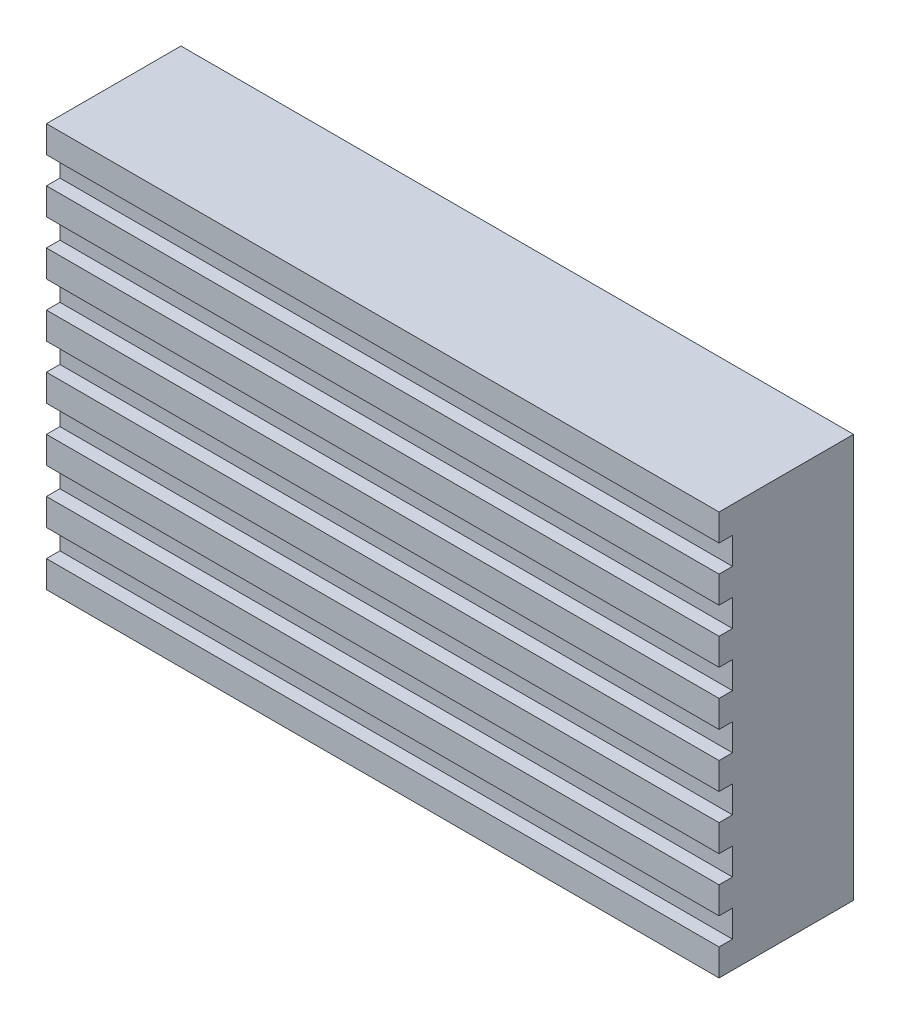
ISO-10303-21;
HEADER;
FILE_DESCRIPTION(('STEP AP214'),'2;1');
FILE_NAME('part.step','',(''),(''),'','','');
FILE_SCHEMA(('AUTOMOTIVE_DESIGN { 1 0 10303 214 1 1 1 1 }'));
ENDSEC;
DATA;
#1=APPLICATION_CONTEXT('core data for automotive mechanical design processes');
#2=APPLICATION_PROTOCOL_DEFINITION('international standard','automotive_design',2000,#1);
#3=PRODUCT_CONTEXT('',#1,'mechanical');
#4=PRODUCT('Part','Part','',(#3));
#5=PRODUCT_RELATED_PRODUCT_CATEGORY('part','',(#4));
#6=PRODUCT_DEFINITION_FORMATION('','',#4);
#7=PRODUCT_DEFINITION_CONTEXT('part definition',#1,'design');
#8=PRODUCT_DEFINITION('design','',#6,#7);
#9=PRODUCT_DEFINITION_SHAPE('','',#8);
#10=(LENGTH_UNIT() NAMED_UNIT(*) SI_UNIT(.MILLI.,.METRE.));
#11=(NAMED_UNIT(*) PLANE_ANGLE_UNIT() SI_UNIT($,.RADIAN.));
#12=(NAMED_UNIT(*) SI_UNIT($,.STERADIAN.) SOLID_ANGLE_UNIT());
#13=UNCERTAINTY_MEASURE_WITH_UNIT(LENGTH_MEASURE(1.E-05),#10,'distance_accuracy_value','');
#14=(GEOMETRIC_REPRESENTATION_CONTEXT(3) GLOBAL_UNCERTAINTY_ASSIGNED_CONTEXT((#13)) GLOBAL_UNIT_ASSIGNED_CONTEXT((#10,
#11,#12)) REPRESENTATION_CONTEXT('',''));
#15=CARTESIAN_POINT('',(0.,0.,0.));
#16=DIRECTION('',(0.,0.,1.));
#17=DIRECTION('',(1.,0.,0.));
#18=AXIS2_PLACEMENT_3D('',#15,#16,#17);
#19=CARTESIAN_POINT('',(0.,0.,10.));
#20=DIRECTION('',(0.,0.,-1.));
#21=DIRECTION('',(-1.,0.,0.));
#22=AXIS2_PLACEMENT_3D('',#19,#20,#21);
#23=PLANE('',#22);
#24=DIRECTION('',(0.,-1.,0.));
#25=VECTOR('',#24,1.);
#26=CARTESIAN_POINT('',(-50.,0.,10.));
#27=LINE('',#26,#25);
#28=CARTESIAN_POINT('',(-50.,-24.,10.));
#29=VERTEX_POINT('',#28);
#30=CARTESIAN_POINT('',(-49.9999999999998,-26.,10.));
#31=VERTEX_POINT('',#30);
#32=EDGE_CURVE('E489',#29,#31,#27,.T.);
#33=ORIENTED_EDGE('',*,*,#32,.T.);
#34=DIRECTION('',(-1.,0.,0.));
#35=VECTOR('',#34,1.);
#36=CARTESIAN_POINT('',(-49.9999999999998,-26.,10.));
#37=LINE('',#36,#35);
#38=CARTESIAN_POINT('',(2.55060596794148E-13,-26.,10.));
#39=VERTEX_POINT('',#38);
#40=EDGE_CURVE('E250',#39,#31,#37,.T.);
#41=ORIENTED_EDGE('',*,*,#40,.F.);
#42=DIRECTION('',(0.,1.,0.));
#43=VECTOR('',#42,1.);
#44=CARTESIAN_POINT('',(0.,0.,10.));
#45=LINE('',#44,#43);
#46=CARTESIAN_POINT('',(2.34111708761089E-13,-24.,10.));
#47=VERTEX_POINT('',#46);
#48=EDGE_CURVE('E445',#39,#47,#45,.T.);
#49=ORIENTED_EDGE('',*,*,#48,.T.);
#50=DIRECTION('',(1.,0.,0.));
#51=VECTOR('',#50,1.);
#52=CARTESIAN_POINT('',(-49.9999999999998,-24.,10.));
#53=LINE('',#52,#51);
#54=EDGE_CURVE('E286',#29,#47,#53,.T.);
#55=ORIENTED_EDGE('',*,*,#54,.F.);
#56=EDGE_LOOP('',(#33,#41,#49,#55));
#57=FACE_BOUND('',#56,.T.);
#58=ADVANCED_FACE('F35',(#57),#23,.F.);
#59=CARTESIAN_POINT('',(-50.,-20.,10.));
#60=VERTEX_POINT('',#59);
#61=CARTESIAN_POINT('',(-49.9999999999998,-22.,10.));
#62=VERTEX_POINT('',#61);
#63=EDGE_CURVE('E490',#60,#62,#27,.T.);
#64=ORIENTED_EDGE('',*,*,#63,.T.);
#65=DIRECTION('',(-1.,0.,0.));
#66=VECTOR('',#65,1.);
#67=CARTESIAN_POINT('',(-49.9999999999998,-22.,10.));
#68=LINE('',#67,#66);
#69=CARTESIAN_POINT('',(2.1316282072803E-13,-22.,10.));
#70=VERTEX_POINT('',#69);
#71=EDGE_CURVE('E277',#70,#62,#68,.T.);
#72=ORIENTED_EDGE('',*,*,#71,.F.);
#73=CARTESIAN_POINT('',(1.92213932694971E-13,-20.,10.));
#74=VERTEX_POINT('',#73);
#75=EDGE_CURVE('E826',#70,#74,#45,.T.);
#76=ORIENTED_EDGE('',*,*,#75,.T.);
#77=DIRECTION('',(1.,0.,0.));
#78=VECTOR('',#77,1.);
#79=CARTESIAN_POINT('',(-49.9999999999998,-20.,10.));
#80=LINE('',#79,#78);
#81=EDGE_CURVE('E311',#60,#74,#80,.T.);
#82=ORIENTED_EDGE('',*,*,#81,.F.);
#83=EDGE_LOOP('',(#64,#72,#76,#82));
#84=FACE_BOUND('',#83,.T.);
#85=ADVANCED_FACE('F551',(#84),#23,.F.);
#86=CARTESIAN_POINT('',(-50.,-16.,10.));
#87=VERTEX_POINT('',#86);
#88=CARTESIAN_POINT('',(-49.9999999999998,-18.,10.));
#89=VERTEX_POINT('',#88);
#90=EDGE_CURVE('E493',#87,#89,#27,.T.);
#91=ORIENTED_EDGE('',*,*,#90,.T.);
#92=DIRECTION('',(-1.,0.,0.));
#93=VECTOR('',#92,1.);
#94=CARTESIAN_POINT('',(-49.9999999999998,-18.,10.));
#95=LINE('',#94,#93);
#96=CARTESIAN_POINT('',(1.71265044661912E-13,-18.,10.));
#97=VERTEX_POINT('',#96);
#98=EDGE_CURVE('E300',#97,#89,#95,.T.);
#99=ORIENTED_EDGE('',*,*,#98,.F.);
#100=CARTESIAN_POINT('',(1.50316156628854E-13,-16.,10.));
#101=VERTEX_POINT('',#100);
#102=EDGE_CURVE('E833',#97,#101,#45,.T.);
#103=ORIENTED_EDGE('',*,*,#102,.T.);
#104=DIRECTION('',(1.,0.,0.));
#105=VECTOR('',#104,1.);
#106=CARTESIAN_POINT('',(-49.9999999999999,-16.,10.));
#107=LINE('',#106,#105);
#108=EDGE_CURVE('E338',#87,#101,#107,.T.);
#109=ORIENTED_EDGE('',*,*,#108,.F.);
#110=EDGE_LOOP('',(#91,#99,#103,#109));
#111=FACE_BOUND('',#110,.T.);
#112=ADVANCED_FACE('F557',(#111),#23,.F.);
#113=CARTESIAN_POINT('',(-50.,-12.,10.));
#114=VERTEX_POINT('',#113);
#115=CARTESIAN_POINT('',(-49.9999999999999,-14.,10.));
#116=VERTEX_POINT('',#115);
#117=EDGE_CURVE('E499',#114,#116,#27,.T.);
#118=ORIENTED_EDGE('',*,*,#117,.T.);
#119=DIRECTION('',(-1.,0.,0.));
#120=VECTOR('',#119,1.);
#121=CARTESIAN_POINT('',(-49.9999999999999,-14.,10.));
#122=LINE('',#121,#120);
#123=CARTESIAN_POINT('',(1.29367268595795E-13,-14.,10.));
#124=VERTEX_POINT('',#123);
#125=EDGE_CURVE('E326',#124,#116,#122,.T.);
#126=ORIENTED_EDGE('',*,*,#125,.F.);
#127=CARTESIAN_POINT('',(1.08418380562736E-13,-12.,10.));
#128=VERTEX_POINT('',#127);
#129=EDGE_CURVE('E535',#124,#128,#45,.T.);
#130=ORIENTED_EDGE('',*,*,#129,.T.);
#131=DIRECTION('',(1.,0.,0.));
#132=VECTOR('',#131,1.);
#133=CARTESIAN_POINT('',(-49.9999999999999,-12.,10.));
#134=LINE('',#133,#132);
#135=EDGE_CURVE('E365',#114,#128,#134,.T.);
#136=ORIENTED_EDGE('',*,*,#135,.F.);
#137=EDGE_LOOP('',(#118,#126,#130,#136));
#138=FACE_BOUND('',#137,.T.);
#139=ADVANCED_FACE('F574',(#138),#23,.F.);
#140=CARTESIAN_POINT('',(-50.,-8.,10.));
#141=VERTEX_POINT('',#140);
#142=CARTESIAN_POINT('',(-49.9999999999999,-10.,10.));
#143=VERTEX_POINT('',#142);
#144=EDGE_CURVE('E505',#141,#143,#27,.T.);
#145=ORIENTED_EDGE('',*,*,#144,.T.);
#146=DIRECTION('',(-1.,0.,0.));
#147=VECTOR('',#146,1.);
#148=CARTESIAN_POINT('',(-49.9999999999999,-10.,10.));
#149=LINE('',#148,#147);
#150=CARTESIAN_POINT('',(0.,-10.,10.));
#151=VERTEX_POINT('',#150);
#152=EDGE_CURVE('E353',#151,#143,#149,.T.);
#153=ORIENTED_EDGE('',*,*,#152,.F.);
#154=CARTESIAN_POINT('',(0.,-8.,10.));
#155=VERTEX_POINT('',#154);
#156=EDGE_CURVE('E534',#151,#155,#45,.T.);
#157=ORIENTED_EDGE('',*,*,#156,.T.);
#158=DIRECTION('',(1.,0.,0.));
#159=VECTOR('',#158,1.);
#160=CARTESIAN_POINT('',(-49.9999999999999,-8.,10.));
#161=LINE('',#160,#159);
#162=EDGE_CURVE('E392',#141,#155,#161,.T.);
#163=ORIENTED_EDGE('',*,*,#162,.F.);
#164=EDGE_LOOP('',(#145,#153,#157,#163));
#165=FACE_BOUND('',#164,.T.);
#166=ADVANCED_FACE('F570',(#165),#23,.F.);
#167=CARTESIAN_POINT('',(-50.,-4.,10.));
#168=VERTEX_POINT('',#167);
#169=CARTESIAN_POINT('',(-50.,-6.,10.));
#170=VERTEX_POINT('',#169);
#171=EDGE_CURVE('E453',#168,#170,#27,.T.);
#172=ORIENTED_EDGE('',*,*,#171,.T.);
#173=DIRECTION('',(-1.,0.,0.));
#174=VECTOR('',#173,1.);
#175=CARTESIAN_POINT('',(-50.,-6.,10.));
#176=LINE('',#175,#174);
#177=CARTESIAN_POINT('',(0.,-6.,10.));
#178=VERTEX_POINT('',#177);
#179=EDGE_CURVE('E380',#178,#170,#176,.T.);
#180=ORIENTED_EDGE('',*,*,#179,.F.);
#181=CARTESIAN_POINT('',(0.,-4.,10.));
#182=VERTEX_POINT('',#181);
#183=EDGE_CURVE('E532',#178,#182,#45,.T.);
#184=ORIENTED_EDGE('',*,*,#183,.T.);
#185=DIRECTION('',(1.,0.,0.));
#186=VECTOR('',#185,1.);
#187=CARTESIAN_POINT('',(-50.,-4.,10.));
#188=LINE('',#187,#186);
#189=EDGE_CURVE('E407',#168,#182,#188,.T.);
#190=ORIENTED_EDGE('',*,*,#189,.F.);
#191=EDGE_LOOP('',(#172,#180,#184,#190));
#192=FACE_BOUND('',#191,.T.);
#193=ADVANCED_FACE('F520',(#192),#23,.F.);
#194=CARTESIAN_POINT('',(-50.,0.,10.));
#195=VERTEX_POINT('',#194);
#196=CARTESIAN_POINT('',(-50.,-2.,10.));
#197=VERTEX_POINT('',#196);
#198=EDGE_CURVE('E449',#195,#197,#27,.T.);
#199=ORIENTED_EDGE('',*,*,#198,.T.);
#200=DIRECTION('',(-1.,0.,0.));
#201=VECTOR('',#200,1.);
#202=CARTESIAN_POINT('',(-50.,-2.,10.));
#203=LINE('',#202,#201);
#204=CARTESIAN_POINT('',(0.,-2.,10.));
#205=VERTEX_POINT('',#204);
#206=EDGE_CURVE('E419',#205,#197,#203,.T.);
#207=ORIENTED_EDGE('',*,*,#206,.F.);
#208=CARTESIAN_POINT('',(0.,0.,10.));
#209=VERTEX_POINT('',#208);
#210=EDGE_CURVE('E446',#205,#209,#45,.T.);
#211=ORIENTED_EDGE('',*,*,#210,.T.);
#212=DIRECTION('',(-1.,0.,0.));
#213=VECTOR('',#212,1.);
#214=CARTESIAN_POINT('',(0.,0.,10.));
#215=LINE('',#214,#213);
#216=EDGE_CURVE('E444',#209,#195,#215,.T.);
#217=ORIENTED_EDGE('',*,*,#216,.T.);
#218=EDGE_LOOP('',(#199,#207,#211,#217));
#219=FACE_BOUND('',#218,.T.);
#220=ADVANCED_FACE('F539',(#219),#23,.F.);
#221=CARTESIAN_POINT('',(0.,0.,10.));
#222=DIRECTION('',(-1.,0.,0.));
#223=DIRECTION('',(0.,-1.,0.));
#224=AXIS2_PLACEMENT_3D('',#221,#222,#223);
#225=PLANE('',#224);
#226=ORIENTED_EDGE('',*,*,#48,.F.);
#227=DIRECTION('',(0.,0.,1.));
#228=VECTOR('',#227,1.);
#229=CARTESIAN_POINT('',(2.55060596794148E-13,-26.,9.));
#230=LINE('',#229,#228);
#231=CARTESIAN_POINT('',(2.55060596794148E-13,-26.,9.));
#232=VERTEX_POINT('',#231);
#233=EDGE_CURVE('E275',#232,#39,#230,.T.);
#234=ORIENTED_EDGE('',*,*,#233,.F.);
#235=DIRECTION('',(0.,1.,0.));
#236=VECTOR('',#235,1.);
#237=CARTESIAN_POINT('',(2.55060596794148E-13,-26.,9.));
#238=LINE('',#237,#236);
#239=CARTESIAN_POINT('',(2.76009484827206E-13,-28.,9.));
#240=VERTEX_POINT('',#239);
#241=EDGE_CURVE('E255',#240,#232,#238,.T.);
#242=ORIENTED_EDGE('',*,*,#241,.F.);
#243=DIRECTION('',(0.,0.,1.));
#244=VECTOR('',#243,1.);
#245=CARTESIAN_POINT('',(2.76009484827206E-13,-28.,9.));
#246=LINE('',#245,#244);
#247=CARTESIAN_POINT('',(2.76009484827206E-13,-28.,10.));
#248=VERTEX_POINT('',#247);
#249=EDGE_CURVE('E278',#240,#248,#246,.T.);
#250=ORIENTED_EDGE('',*,*,#249,.T.);
#251=CARTESIAN_POINT('',(0.,-30.,10.));
#252=VERTEX_POINT('',#251);
#253=EDGE_CURVE('E441',#252,#248,#45,.T.);
#254=ORIENTED_EDGE('',*,*,#253,.F.);
#255=DIRECTION('',(0.,0.,-1.));
#256=VECTOR('',#255,1.);
#257=CARTESIAN_POINT('',(0.,-30.,10.));
#258=LINE('',#257,#256);
#259=CARTESIAN_POINT('',(0.,-30.,0.));
#260=VERTEX_POINT('',#259);
#261=EDGE_CURVE('E455',#252,#260,#258,.T.);
#262=ORIENTED_EDGE('',*,*,#261,.T.);
#263=DIRECTION('',(0.,1.,0.));
#264=VECTOR('',#263,1.);
#265=CARTESIAN_POINT('',(0.,0.,0.));
#266=LINE('',#265,#264);
#267=CARTESIAN_POINT('',(0.,0.,0.));
#268=VERTEX_POINT('',#267);
#269=EDGE_CURVE('E434',#260,#268,#266,.T.);
#270=ORIENTED_EDGE('',*,*,#269,.T.);
#271=DIRECTION('',(0.,0.,-1.));
#272=VECTOR('',#271,1.);
#273=CARTESIAN_POINT('',(0.,0.,10.));
#274=LINE('',#273,#272);
#275=EDGE_CURVE('E11',#209,#268,#274,.T.);
#276=ORIENTED_EDGE('',*,*,#275,.F.);
#277=ORIENTED_EDGE('',*,*,#210,.F.);
#278=DIRECTION('',(0.,0.,1.));
#279=VECTOR('',#278,1.);
#280=CARTESIAN_POINT('',(0.,-2.,9.));
#281=LINE('',#280,#279);
#282=CARTESIAN_POINT('',(0.,-2.,9.));
#283=VERTEX_POINT('',#282);
#284=EDGE_CURVE('E435',#283,#205,#281,.T.);
#285=ORIENTED_EDGE('',*,*,#284,.F.);
#286=DIRECTION('',(0.,1.,0.));
#287=VECTOR('',#286,1.);
#288=CARTESIAN_POINT('',(0.,-2.,9.));
#289=LINE('',#288,#287);
#290=CARTESIAN_POINT('',(0.,-4.,9.));
#291=VERTEX_POINT('',#290);
#292=EDGE_CURVE('E422',#291,#283,#289,.T.);
#293=ORIENTED_EDGE('',*,*,#292,.F.);
#294=DIRECTION('',(0.,0.,1.));
#295=VECTOR('',#294,1.);
#296=CARTESIAN_POINT('',(0.,-4.,9.));
#297=LINE('',#296,#295);
#298=EDGE_CURVE('E437',#291,#182,#297,.T.);
#299=ORIENTED_EDGE('',*,*,#298,.T.);
#300=ORIENTED_EDGE('',*,*,#183,.F.);
#301=DIRECTION('',(0.,0.,1.));
#302=VECTOR('',#301,1.);
#303=CARTESIAN_POINT('',(0.,-6.,9.));
#304=LINE('',#303,#302);
#305=CARTESIAN_POINT('',(0.,-6.,9.));
#306=VERTEX_POINT('',#305);
#307=EDGE_CURVE('E405',#306,#178,#304,.T.);
#308=ORIENTED_EDGE('',*,*,#307,.F.);
#309=DIRECTION('',(0.,1.,0.));
#310=VECTOR('',#309,1.);
#311=CARTESIAN_POINT('',(0.,-6.,9.));
#312=LINE('',#311,#310);
#313=CARTESIAN_POINT('',(0.,-8.,9.));
#314=VERTEX_POINT('',#313);
#315=EDGE_CURVE('E398',#314,#306,#312,.T.);
#316=ORIENTED_EDGE('',*,*,#315,.F.);
#317=DIRECTION('',(0.,0.,1.));
#318=VECTOR('',#317,1.);
#319=CARTESIAN_POINT('',(0.,-8.,9.));
#320=LINE('',#319,#318);
#321=EDGE_CURVE('E408',#314,#155,#320,.T.);
#322=ORIENTED_EDGE('',*,*,#321,.T.);
#323=ORIENTED_EDGE('',*,*,#156,.F.);
#324=DIRECTION('',(0.,0.,1.));
#325=VECTOR('',#324,1.);
#326=CARTESIAN_POINT('',(0.,-10.,9.));
#327=LINE('',#326,#325);
#328=CARTESIAN_POINT('',(0.,-10.,9.));
#329=VERTEX_POINT('',#328);
#330=EDGE_CURVE('E378',#329,#151,#327,.T.);
#331=ORIENTED_EDGE('',*,*,#330,.F.);
#332=DIRECTION('',(0.,1.,0.));
#333=VECTOR('',#332,1.);
#334=CARTESIAN_POINT('',(0.,-10.,9.));
#335=LINE('',#334,#333);
#336=CARTESIAN_POINT('',(1.08418380562736E-13,-12.,9.));
#337=VERTEX_POINT('',#336);
#338=EDGE_CURVE('E371',#337,#329,#335,.T.);
#339=ORIENTED_EDGE('',*,*,#338,.F.);
#340=DIRECTION('',(0.,0.,1.));
#341=VECTOR('',#340,1.);
#342=CARTESIAN_POINT('',(1.08418380562736E-13,-12.,9.));
#343=LINE('',#342,#341);
#344=EDGE_CURVE('E381',#337,#128,#343,.T.);
#345=ORIENTED_EDGE('',*,*,#344,.T.);
#346=ORIENTED_EDGE('',*,*,#129,.F.);
#347=DIRECTION('',(0.,0.,1.));
#348=VECTOR('',#347,1.);
#349=CARTESIAN_POINT('',(1.29367268595795E-13,-14.,9.));
#350=LINE('',#349,#348);
#351=CARTESIAN_POINT('',(1.29367268595795E-13,-14.,9.));
#352=VERTEX_POINT('',#351);
#353=EDGE_CURVE('E351',#352,#124,#350,.T.);
#354=ORIENTED_EDGE('',*,*,#353,.F.);
#355=DIRECTION('',(0.,1.,0.));
#356=VECTOR('',#355,1.);
#357=CARTESIAN_POINT('',(1.29367268595795E-13,-14.,9.));
#358=LINE('',#357,#356);
#359=CARTESIAN_POINT('',(1.50316156628854E-13,-16.,9.));
#360=VERTEX_POINT('',#359);
#361=EDGE_CURVE('E344',#360,#352,#358,.T.);
#362=ORIENTED_EDGE('',*,*,#361,.F.);
#363=DIRECTION('',(0.,0.,1.));
#364=VECTOR('',#363,1.);
#365=CARTESIAN_POINT('',(1.50316156628854E-13,-16.,9.));
#366=LINE('',#365,#364);
#367=EDGE_CURVE('E354',#360,#101,#366,.T.);
#368=ORIENTED_EDGE('',*,*,#367,.T.);
#369=ORIENTED_EDGE('',*,*,#102,.F.);
#370=DIRECTION('',(0.,0.,1.));
#371=VECTOR('',#370,1.);
#372=CARTESIAN_POINT('',(1.71265044661912E-13,-18.,9.));
#373=LINE('',#372,#371);
#374=CARTESIAN_POINT('',(1.71265044661912E-13,-18.,9.));
#375=VERTEX_POINT('',#374);
#376=EDGE_CURVE('E324',#375,#97,#373,.T.);
#377=ORIENTED_EDGE('',*,*,#376,.F.);
#378=DIRECTION('',(0.,1.,0.));
#379=VECTOR('',#378,1.);
#380=CARTESIAN_POINT('',(1.71265044661912E-13,-18.,9.));
#381=LINE('',#380,#379);
#382=CARTESIAN_POINT('',(1.92213932694971E-13,-20.,9.));
#383=VERTEX_POINT('',#382);
#384=EDGE_CURVE('E317',#383,#375,#381,.T.);
#385=ORIENTED_EDGE('',*,*,#384,.F.);
#386=DIRECTION('',(0.,0.,1.));
#387=VECTOR('',#386,1.);
#388=CARTESIAN_POINT('',(1.92213932694971E-13,-20.,9.));
#389=LINE('',#388,#387);
#390=EDGE_CURVE('E327',#383,#74,#389,.T.);
#391=ORIENTED_EDGE('',*,*,#390,.T.);
#392=ORIENTED_EDGE('',*,*,#75,.F.);
#393=DIRECTION('',(0.,0.,1.));
#394=VECTOR('',#393,1.);
#395=CARTESIAN_POINT('',(2.1316282072803E-13,-22.,9.));
#396=LINE('',#395,#394);
#397=CARTESIAN_POINT('',(2.1316282072803E-13,-22.,9.));
#398=VERTEX_POINT('',#397);
#399=EDGE_CURVE('E298',#398,#70,#396,.T.);
#400=ORIENTED_EDGE('',*,*,#399,.F.);
#401=DIRECTION('',(0.,1.,0.));
#402=VECTOR('',#401,1.);
#403=CARTESIAN_POINT('',(2.1316282072803E-13,-22.,9.));
#404=LINE('',#403,#402);
#405=CARTESIAN_POINT('',(2.34111708761089E-13,-24.,9.));
#406=VERTEX_POINT('',#405);
#407=EDGE_CURVE('E292',#406,#398,#404,.T.);
#408=ORIENTED_EDGE('',*,*,#407,.F.);
#409=DIRECTION('',(0.,0.,1.));
#410=VECTOR('',#409,1.);
#411=CARTESIAN_POINT('',(2.34111708761089E-13,-24.,9.));
#412=LINE('',#411,#410);
#413=EDGE_CURVE('E301',#406,#47,#412,.T.);
#414=ORIENTED_EDGE('',*,*,#413,.T.);
#415=EDGE_LOOP('',(#226,#234,#242,#250,#254,#262,#270,#276,#277,#285,#293,#299,#300,#308,#316,
#322,#323,#331,#339,#345,#346,#354,#362,#368,#369,#377,#385,#391,#392,#400,#408,#414));
#416=FACE_BOUND('',#415,.T.);
#417=ADVANCED_FACE('F37',(#416),#225,.F.);
#418=CARTESIAN_POINT('',(0.,0.,10.));
#419=DIRECTION('',(0.,-1.,0.));
#420=DIRECTION('',(1.,0.,0.));
#421=AXIS2_PLACEMENT_3D('',#418,#419,#420);
#422=PLANE('',#421);
#423=DIRECTION('',(-1.,0.,0.));
#424=VECTOR('',#423,1.);
#425=CARTESIAN_POINT('',(0.,0.,0.));
#426=LINE('',#425,#424);
#427=CARTESIAN_POINT('',(-50.,0.,0.));
#428=VERTEX_POINT('',#427);
#429=EDGE_CURVE('E458',#268,#428,#426,.T.);
#430=ORIENTED_EDGE('',*,*,#429,.T.);
#431=DIRECTION('',(0.,0.,-1.));
#432=VECTOR('',#431,1.);
#433=CARTESIAN_POINT('',(-50.,0.,10.));
#434=LINE('',#433,#432);
#435=EDGE_CURVE('E43',#195,#428,#434,.T.);
#436=ORIENTED_EDGE('',*,*,#435,.F.);
#437=ORIENTED_EDGE('',*,*,#216,.F.);
#438=ORIENTED_EDGE('',*,*,#275,.T.);
#439=EDGE_LOOP('',(#430,#436,#437,#438));
#440=FACE_BOUND('',#439,.T.);
#441=ADVANCED_FACE('F541',(#440),#422,.F.);
#442=CARTESIAN_POINT('',(-50.,0.,10.));
#443=DIRECTION('',(1.,0.,0.));
#444=DIRECTION('',(0.,1.,0.));
#445=AXIS2_PLACEMENT_3D('',#442,#443,#444);
#446=PLANE('',#445);
#447=DIRECTION('',(0.,-1.,0.));
#448=VECTOR('',#447,1.);
#449=CARTESIAN_POINT('',(-49.9999999999997,-28.,9.));
#450=LINE('',#449,#448);
#451=CARTESIAN_POINT('',(-49.9999999999998,-26.,9.));
#452=VERTEX_POINT('',#451);
#453=CARTESIAN_POINT('',(-49.9999999999997,-28.,9.));
#454=VERTEX_POINT('',#453);
#455=EDGE_CURVE('E261',#452,#454,#450,.T.);
#456=ORIENTED_EDGE('',*,*,#455,.F.);
#457=DIRECTION('',(0.,0.,1.));
#458=VECTOR('',#457,1.);
#459=CARTESIAN_POINT('',(-49.9999999999998,-26.,9.));
#460=LINE('',#459,#458);
#461=EDGE_CURVE('E244',#452,#31,#460,.T.);
#462=ORIENTED_EDGE('',*,*,#461,.T.);
#463=ORIENTED_EDGE('',*,*,#32,.F.);
#464=DIRECTION('',(0.,0.,1.));
#465=VECTOR('',#464,1.);
#466=CARTESIAN_POINT('',(-49.9999999999998,-24.,9.));
#467=LINE('',#466,#465);
#468=CARTESIAN_POINT('',(-49.9999999999998,-24.,9.));
#469=VERTEX_POINT('',#468);
#470=EDGE_CURVE('E58',#469,#29,#467,.T.);
#471=ORIENTED_EDGE('',*,*,#470,.F.);
#472=DIRECTION('',(0.,-1.,0.));
#473=VECTOR('',#472,1.);
#474=CARTESIAN_POINT('',(-49.9999999999998,-24.,9.));
#475=LINE('',#474,#473);
#476=CARTESIAN_POINT('',(-49.9999999999998,-22.,9.));
#477=VERTEX_POINT('',#476);
#478=EDGE_CURVE('E285',#477,#469,#475,.T.);
#479=ORIENTED_EDGE('',*,*,#478,.F.);
#480=DIRECTION('',(0.,0.,1.));
#481=VECTOR('',#480,1.);
#482=CARTESIAN_POINT('',(-49.9999999999998,-22.,9.));
#483=LINE('',#482,#481);
#484=EDGE_CURVE('E295',#477,#62,#483,.T.);
#485=ORIENTED_EDGE('',*,*,#484,.T.);
#486=ORIENTED_EDGE('',*,*,#63,.F.);
#487=DIRECTION('',(0.,0.,1.));
#488=VECTOR('',#487,1.);
#489=CARTESIAN_POINT('',(-49.9999999999998,-20.,9.));
#490=LINE('',#489,#488);
#491=CARTESIAN_POINT('',(-49.9999999999998,-20.,9.));
#492=VERTEX_POINT('',#491);
#493=EDGE_CURVE('E330',#492,#60,#490,.T.);
#494=ORIENTED_EDGE('',*,*,#493,.F.);
#495=DIRECTION('',(0.,-1.,0.));
#496=VECTOR('',#495,1.);
#497=CARTESIAN_POINT('',(-49.9999999999998,-20.,9.));
#498=LINE('',#497,#496);
#499=CARTESIAN_POINT('',(-49.9999999999998,-18.,9.));
#500=VERTEX_POINT('',#499);
#501=EDGE_CURVE('E310',#500,#492,#498,.T.);
#502=ORIENTED_EDGE('',*,*,#501,.F.);
#503=DIRECTION('',(0.,0.,1.));
#504=VECTOR('',#503,1.);
#505=CARTESIAN_POINT('',(-49.9999999999998,-18.,9.));
#506=LINE('',#505,#504);
#507=EDGE_CURVE('E320',#500,#89,#506,.T.);
#508=ORIENTED_EDGE('',*,*,#507,.T.);
#509=ORIENTED_EDGE('',*,*,#90,.F.);
#510=DIRECTION('',(0.,0.,1.));
#511=VECTOR('',#510,1.);
#512=CARTESIAN_POINT('',(-49.9999999999999,-16.,9.));
#513=LINE('',#512,#511);
#514=CARTESIAN_POINT('',(-49.9999999999999,-16.,9.));
#515=VERTEX_POINT('',#514);
#516=EDGE_CURVE('E357',#515,#87,#513,.T.);
#517=ORIENTED_EDGE('',*,*,#516,.F.);
#518=DIRECTION('',(0.,-1.,0.));
#519=VECTOR('',#518,1.);
#520=CARTESIAN_POINT('',(-49.9999999999999,-16.,9.));
#521=LINE('',#520,#519);
#522=CARTESIAN_POINT('',(-49.9999999999999,-14.,9.));
#523=VERTEX_POINT('',#522);
#524=EDGE_CURVE('E337',#523,#515,#521,.T.);
#525=ORIENTED_EDGE('',*,*,#524,.F.);
#526=DIRECTION('',(0.,0.,1.));
#527=VECTOR('',#526,1.);
#528=CARTESIAN_POINT('',(-49.9999999999999,-14.,9.));
#529=LINE('',#528,#527);
#530=EDGE_CURVE('E347',#523,#116,#529,.T.);
#531=ORIENTED_EDGE('',*,*,#530,.T.);
#532=ORIENTED_EDGE('',*,*,#117,.F.);
#533=DIRECTION('',(0.,0.,1.));
#534=VECTOR('',#533,1.);
#535=CARTESIAN_POINT('',(-49.9999999999999,-12.,9.));
#536=LINE('',#535,#534);
#537=CARTESIAN_POINT('',(-49.9999999999999,-12.,9.));
#538=VERTEX_POINT('',#537);
#539=EDGE_CURVE('E384',#538,#114,#536,.T.);
#540=ORIENTED_EDGE('',*,*,#539,.F.);
#541=DIRECTION('',(0.,-1.,0.));
#542=VECTOR('',#541,1.);
#543=CARTESIAN_POINT('',(-49.9999999999999,-12.,9.));
#544=LINE('',#543,#542);
#545=CARTESIAN_POINT('',(-49.9999999999999,-10.,9.));
#546=VERTEX_POINT('',#545);
#547=EDGE_CURVE('E364',#546,#538,#544,.T.);
#548=ORIENTED_EDGE('',*,*,#547,.F.);
#549=DIRECTION('',(0.,0.,1.));
#550=VECTOR('',#549,1.);
#551=CARTESIAN_POINT('',(-49.9999999999999,-10.,9.));
#552=LINE('',#551,#550);
#553=EDGE_CURVE('E374',#546,#143,#552,.T.);
#554=ORIENTED_EDGE('',*,*,#553,.T.);
#555=ORIENTED_EDGE('',*,*,#144,.F.);
#556=DIRECTION('',(0.,0.,1.));
#557=VECTOR('',#556,1.);
#558=CARTESIAN_POINT('',(-49.9999999999999,-8.,9.));
#559=LINE('',#558,#557);
#560=CARTESIAN_POINT('',(-49.9999999999999,-8.,9.));
#561=VERTEX_POINT('',#560);
#562=EDGE_CURVE('E411',#561,#141,#559,.T.);
#563=ORIENTED_EDGE('',*,*,#562,.F.);
#564=DIRECTION('',(0.,-1.,0.));
#565=VECTOR('',#564,1.);
#566=CARTESIAN_POINT('',(-49.9999999999999,-8.,9.));
#567=LINE('',#566,#565);
#568=CARTESIAN_POINT('',(-50.,-6.,9.));
#569=VERTEX_POINT('',#568);
#570=EDGE_CURVE('E391',#569,#561,#567,.T.);
#571=ORIENTED_EDGE('',*,*,#570,.F.);
#572=DIRECTION('',(0.,0.,1.));
#573=VECTOR('',#572,1.);
#574=CARTESIAN_POINT('',(-50.,-6.,9.));
#575=LINE('',#574,#573);
#576=EDGE_CURVE('E401',#569,#170,#575,.T.);
#577=ORIENTED_EDGE('',*,*,#576,.T.);
#578=ORIENTED_EDGE('',*,*,#171,.F.);
#579=DIRECTION('',(0.,0.,1.));
#580=VECTOR('',#579,1.);
#581=CARTESIAN_POINT('',(-50.,-4.,9.));
#582=LINE('',#581,#580);
#583=CARTESIAN_POINT('',(-50.,-4.,9.));
#584=VERTEX_POINT('',#583);
#585=EDGE_CURVE('E427',#584,#168,#582,.T.);
#586=ORIENTED_EDGE('',*,*,#585,.F.);
#587=DIRECTION('',(0.,-1.,0.));
#588=VECTOR('',#587,1.);
#589=CARTESIAN_POINT('',(-50.,-4.,9.));
#590=LINE('',#589,#588);
#591=CARTESIAN_POINT('',(-50.,-2.,9.));
#592=VERTEX_POINT('',#591);
#593=EDGE_CURVE('E415',#592,#584,#590,.T.);
#594=ORIENTED_EDGE('',*,*,#593,.F.);
#595=DIRECTION('',(0.,0.,1.));
#596=VECTOR('',#595,1.);
#597=CARTESIAN_POINT('',(-50.,-2.,9.));
#598=LINE('',#597,#596);
#599=EDGE_CURVE('E431',#592,#197,#598,.T.);
#600=ORIENTED_EDGE('',*,*,#599,.T.);
#601=ORIENTED_EDGE('',*,*,#198,.F.);
#602=ORIENTED_EDGE('',*,*,#435,.T.);
#603=DIRECTION('',(0.,-1.,0.));
#604=VECTOR('',#603,1.);
#605=CARTESIAN_POINT('',(-50.,0.,0.));
#606=LINE('',#605,#604);
#607=CARTESIAN_POINT('',(-50.,-30.,0.));
#608=VERTEX_POINT('',#607);
#609=EDGE_CURVE('E460',#428,#608,#606,.T.);
#610=ORIENTED_EDGE('',*,*,#609,.T.);
#611=DIRECTION('',(0.,0.,-1.));
#612=VECTOR('',#611,1.);
#613=CARTESIAN_POINT('',(-50.,-30.,10.));
#614=LINE('',#613,#612);
#615=CARTESIAN_POINT('',(-50.,-30.,10.));
#616=VERTEX_POINT('',#615);
#617=EDGE_CURVE('E466',#616,#608,#614,.T.);
#618=ORIENTED_EDGE('',*,*,#617,.F.);
#619=CARTESIAN_POINT('',(-50.,-28.,10.));
#620=VERTEX_POINT('',#619);
#621=EDGE_CURVE('E448',#620,#616,#27,.T.);
#622=ORIENTED_EDGE('',*,*,#621,.F.);
#623=DIRECTION('',(0.,0.,1.));
#624=VECTOR('',#623,1.);
#625=CARTESIAN_POINT('',(-49.9999999999997,-28.,9.));
#626=LINE('',#625,#624);
#627=EDGE_CURVE('E50',#454,#620,#626,.T.);
#628=ORIENTED_EDGE('',*,*,#627,.F.);
#629=EDGE_LOOP('',(#456,#462,#463,#471,#479,#485,#486,#494,#502,#508,#509,#517,#525,#531,#532,
#540,#548,#554,#555,#563,#571,#577,#578,#586,#594,#600,#601,#602,#610,#618,#622,#628));
#630=FACE_BOUND('',#629,.T.);
#631=ADVANCED_FACE('F266',(#630),#446,.F.);
#632=CARTESIAN_POINT('',(0.,-30.,10.));
#633=DIRECTION('',(0.,1.,0.));
#634=DIRECTION('',(-1.,0.,0.));
#635=AXIS2_PLACEMENT_3D('',#632,#633,#634);
#636=PLANE('',#635);
#637=DIRECTION('',(1.,0.,0.));
#638=VECTOR('',#637,1.);
#639=CARTESIAN_POINT('',(0.,-30.,0.));
#640=LINE('',#639,#638);
#641=EDGE_CURVE('E462',#608,#260,#640,.T.);
#642=ORIENTED_EDGE('',*,*,#641,.T.);
#643=ORIENTED_EDGE('',*,*,#261,.F.);
#644=DIRECTION('',(1.,0.,0.));
#645=VECTOR('',#644,1.);
#646=CARTESIAN_POINT('',(0.,-30.,10.));
#647=LINE('',#646,#645);
#648=EDGE_CURVE('E452',#616,#252,#647,.T.);
#649=ORIENTED_EDGE('',*,*,#648,.F.);
#650=ORIENTED_EDGE('',*,*,#617,.T.);
#651=EDGE_LOOP('',(#642,#643,#649,#650));
#652=FACE_BOUND('',#651,.T.);
#653=ADVANCED_FACE('F481',(#652),#636,.F.);
#654=ORIENTED_EDGE('',*,*,#253,.T.);
#655=DIRECTION('',(1.,0.,0.));
#656=VECTOR('',#655,1.);
#657=CARTESIAN_POINT('',(-49.9999999999997,-28.,10.));
#658=LINE('',#657,#656);
#659=EDGE_CURVE('E264',#620,#248,#658,.T.);
#660=ORIENTED_EDGE('',*,*,#659,.F.);
#661=ORIENTED_EDGE('',*,*,#621,.T.);
#662=ORIENTED_EDGE('',*,*,#648,.T.);
#663=EDGE_LOOP('',(#654,#660,#661,#662));
#664=FACE_BOUND('',#663,.T.);
#665=ADVANCED_FACE('F488',(#664),#23,.F.);
#666=CARTESIAN_POINT('',(0.,0.,0.));
#667=DIRECTION('',(0.,0.,-1.));
#668=DIRECTION('',(-1.,0.,0.));
#669=AXIS2_PLACEMENT_3D('',#666,#667,#668);
#670=PLANE('',#669);
#671=ORIENTED_EDGE('',*,*,#269,.F.);
#672=ORIENTED_EDGE('',*,*,#641,.F.);
#673=ORIENTED_EDGE('',*,*,#609,.F.);
#674=ORIENTED_EDGE('',*,*,#429,.F.);
#675=EDGE_LOOP('',(#671,#672,#673,#674));
#676=FACE_BOUND('',#675,.T.);
#677=ADVANCED_FACE('F478',(#676),#670,.T.);
#678=CARTESIAN_POINT('',(-50.,-2.,9.));
#679=DIRECTION('',(0.,1.,0.));
#680=DIRECTION('',(-1.,0.,0.));
#681=AXIS2_PLACEMENT_3D('',#678,#679,#680);
#682=PLANE('',#681);
#683=ORIENTED_EDGE('',*,*,#206,.T.);
#684=ORIENTED_EDGE('',*,*,#599,.F.);
#685=DIRECTION('',(-1.,0.,0.));
#686=VECTOR('',#685,1.);
#687=CARTESIAN_POINT('',(-50.,-2.,9.));
#688=LINE('',#687,#686);
#689=EDGE_CURVE('E424',#283,#592,#688,.T.);
#690=ORIENTED_EDGE('',*,*,#689,.F.);
#691=ORIENTED_EDGE('',*,*,#284,.T.);
#692=EDGE_LOOP('',(#683,#684,#690,#691));
#693=FACE_BOUND('',#692,.T.);
#694=ADVANCED_FACE('F563',(#693),#682,.F.);
#695=CARTESIAN_POINT('',(-50.,-4.,9.));
#696=DIRECTION('',(0.,-1.,0.));
#697=DIRECTION('',(1.,0.,0.));
#698=AXIS2_PLACEMENT_3D('',#695,#696,#697);
#699=PLANE('',#698);
#700=ORIENTED_EDGE('',*,*,#189,.T.);
#701=ORIENTED_EDGE('',*,*,#298,.F.);
#702=DIRECTION('',(1.,0.,0.));
#703=VECTOR('',#702,1.);
#704=CARTESIAN_POINT('',(-50.,-4.,9.));
#705=LINE('',#704,#703);
#706=EDGE_CURVE('E418',#584,#291,#705,.T.);
#707=ORIENTED_EDGE('',*,*,#706,.F.);
#708=ORIENTED_EDGE('',*,*,#585,.T.);
#709=EDGE_LOOP('',(#700,#701,#707,#708));
#710=FACE_BOUND('',#709,.T.);
#711=ADVANCED_FACE('F633',(#710),#699,.F.);
#712=CARTESIAN_POINT('',(0.,0.,9.));
#713=DIRECTION('',(0.,0.,-1.));
#714=DIRECTION('',(-1.,0.,0.));
#715=AXIS2_PLACEMENT_3D('',#712,#713,#714);
#716=PLANE('',#715);
#717=ORIENTED_EDGE('',*,*,#593,.T.);
#718=ORIENTED_EDGE('',*,*,#706,.T.);
#719=ORIENTED_EDGE('',*,*,#292,.T.);
#720=ORIENTED_EDGE('',*,*,#689,.T.);
#721=EDGE_LOOP('',(#717,#718,#719,#720));
#722=FACE_BOUND('',#721,.T.);
#723=ADVANCED_FACE('F643',(#722),#716,.F.);
#724=CARTESIAN_POINT('',(-50.,-6.,9.));
#725=DIRECTION('',(0.,1.,0.));
#726=DIRECTION('',(-1.,0.,0.));
#727=AXIS2_PLACEMENT_3D('',#724,#725,#726);
#728=PLANE('',#727);
#729=ORIENTED_EDGE('',*,*,#179,.T.);
#730=ORIENTED_EDGE('',*,*,#576,.F.);
#731=DIRECTION('',(-1.,0.,0.));
#732=VECTOR('',#731,1.);
#733=CARTESIAN_POINT('',(-50.,-6.,9.));
#734=LINE('',#733,#732);
#735=EDGE_CURVE('E388',#306,#569,#734,.T.);
#736=ORIENTED_EDGE('',*,*,#735,.F.);
#737=ORIENTED_EDGE('',*,*,#307,.T.);
#738=EDGE_LOOP('',(#729,#730,#736,#737));
#739=FACE_BOUND('',#738,.T.);
#740=ADVANCED_FACE('F527',(#739),#728,.F.);
#741=CARTESIAN_POINT('',(-49.9999999999999,-8.,9.));
#742=DIRECTION('',(0.,-1.,0.));
#743=DIRECTION('',(1.,0.,0.));
#744=AXIS2_PLACEMENT_3D('',#741,#742,#743);
#745=PLANE('',#744);
#746=ORIENTED_EDGE('',*,*,#162,.T.);
#747=ORIENTED_EDGE('',*,*,#321,.F.);
#748=DIRECTION('',(1.,0.,0.));
#749=VECTOR('',#748,1.);
#750=CARTESIAN_POINT('',(-49.9999999999999,-8.,9.));
#751=LINE('',#750,#749);
#752=EDGE_CURVE('E395',#561,#314,#751,.T.);
#753=ORIENTED_EDGE('',*,*,#752,.F.);
#754=ORIENTED_EDGE('',*,*,#562,.T.);
#755=EDGE_LOOP('',(#746,#747,#753,#754));
#756=FACE_BOUND('',#755,.T.);
#757=ADVANCED_FACE('F661',(#756),#745,.F.);
#758=CARTESIAN_POINT('',(0.,0.,9.));
#759=DIRECTION('',(0.,0.,-1.));
#760=DIRECTION('',(-1.,0.,0.));
#761=AXIS2_PLACEMENT_3D('',#758,#759,#760);
#762=PLANE('',#761);
#763=ORIENTED_EDGE('',*,*,#735,.T.);
#764=ORIENTED_EDGE('',*,*,#570,.T.);
#765=ORIENTED_EDGE('',*,*,#752,.T.);
#766=ORIENTED_EDGE('',*,*,#315,.T.);
#767=EDGE_LOOP('',(#763,#764,#765,#766));
#768=FACE_BOUND('',#767,.T.);
#769=ADVANCED_FACE('F529',(#768),#762,.F.);
#770=CARTESIAN_POINT('',(-49.9999999999999,-10.,9.));
#771=DIRECTION('',(0.,1.,0.));
#772=DIRECTION('',(-1.,0.,0.));
#773=AXIS2_PLACEMENT_3D('',#770,#771,#772);
#774=PLANE('',#773);
#775=ORIENTED_EDGE('',*,*,#152,.T.);
#776=ORIENTED_EDGE('',*,*,#553,.F.);
#777=DIRECTION('',(-1.,0.,0.));
#778=VECTOR('',#777,1.);
#779=CARTESIAN_POINT('',(-49.9999999999999,-10.,9.));
#780=LINE('',#779,#778);
#781=EDGE_CURVE('E361',#329,#546,#780,.T.);
#782=ORIENTED_EDGE('',*,*,#781,.F.);
#783=ORIENTED_EDGE('',*,*,#330,.T.);
#784=EDGE_LOOP('',(#775,#776,#782,#783));
#785=FACE_BOUND('',#784,.T.);
#786=ADVANCED_FACE('F679',(#785),#774,.F.);
#787=CARTESIAN_POINT('',(-49.9999999999999,-12.,9.));
#788=DIRECTION('',(0.,-1.,0.));
#789=DIRECTION('',(1.,0.,0.));
#790=AXIS2_PLACEMENT_3D('',#787,#788,#789);
#791=PLANE('',#790);
#792=ORIENTED_EDGE('',*,*,#135,.T.);
#793=ORIENTED_EDGE('',*,*,#344,.F.);
#794=DIRECTION('',(1.,0.,0.));
#795=VECTOR('',#794,1.);
#796=CARTESIAN_POINT('',(-49.9999999999999,-12.,9.));
#797=LINE('',#796,#795);
#798=EDGE_CURVE('E368',#538,#337,#797,.T.);
#799=ORIENTED_EDGE('',*,*,#798,.F.);
#800=ORIENTED_EDGE('',*,*,#539,.T.);
#801=EDGE_LOOP('',(#792,#793,#799,#800));
#802=FACE_BOUND('',#801,.T.);
#803=ADVANCED_FACE('F688',(#802),#791,.F.);
#804=CARTESIAN_POINT('',(0.,0.,9.));
#805=DIRECTION('',(0.,0.,-1.));
#806=DIRECTION('',(-1.,0.,0.));
#807=AXIS2_PLACEMENT_3D('',#804,#805,#806);
#808=PLANE('',#807);
#809=ORIENTED_EDGE('',*,*,#781,.T.);
#810=ORIENTED_EDGE('',*,*,#547,.T.);
#811=ORIENTED_EDGE('',*,*,#798,.T.);
#812=ORIENTED_EDGE('',*,*,#338,.T.);
#813=EDGE_LOOP('',(#809,#810,#811,#812));
#814=FACE_BOUND('',#813,.T.);
#815=ADVANCED_FACE('F698',(#814),#808,.F.);
#816=CARTESIAN_POINT('',(-49.9999999999999,-14.,9.));
#817=DIRECTION('',(0.,1.,0.));
#818=DIRECTION('',(-1.,0.,0.));
#819=AXIS2_PLACEMENT_3D('',#816,#817,#818);
#820=PLANE('',#819);
#821=ORIENTED_EDGE('',*,*,#125,.T.);
#822=ORIENTED_EDGE('',*,*,#530,.F.);
#823=DIRECTION('',(-1.,0.,0.));
#824=VECTOR('',#823,1.);
#825=CARTESIAN_POINT('',(-49.9999999999999,-14.,9.));
#826=LINE('',#825,#824);
#827=EDGE_CURVE('E334',#352,#523,#826,.T.);
#828=ORIENTED_EDGE('',*,*,#827,.F.);
#829=ORIENTED_EDGE('',*,*,#353,.T.);
#830=EDGE_LOOP('',(#821,#822,#828,#829));
#831=FACE_BOUND('',#830,.T.);
#832=ADVANCED_FACE('F708',(#831),#820,.F.);
#833=CARTESIAN_POINT('',(-49.9999999999999,-16.,9.));
#834=DIRECTION('',(0.,-1.,0.));
#835=DIRECTION('',(0.,0.,-1.));
#836=AXIS2_PLACEMENT_3D('',#833,#834,#835);
#837=PLANE('',#836);
#838=ORIENTED_EDGE('',*,*,#108,.T.);
#839=ORIENTED_EDGE('',*,*,#367,.F.);
#840=DIRECTION('',(1.,0.,0.));
#841=VECTOR('',#840,1.);
#842=CARTESIAN_POINT('',(-49.9999999999999,-16.,9.));
#843=LINE('',#842,#841);
#844=EDGE_CURVE('E341',#515,#360,#843,.T.);
#845=ORIENTED_EDGE('',*,*,#844,.F.);
#846=ORIENTED_EDGE('',*,*,#516,.T.);
#847=EDGE_LOOP('',(#838,#839,#845,#846));
#848=FACE_BOUND('',#847,.T.);
#849=ADVANCED_FACE('F718',(#848),#837,.F.);
#850=CARTESIAN_POINT('',(0.,0.,9.));
#851=DIRECTION('',(0.,0.,-1.));
#852=DIRECTION('',(-1.,0.,0.));
#853=AXIS2_PLACEMENT_3D('',#850,#851,#852);
#854=PLANE('',#853);
#855=ORIENTED_EDGE('',*,*,#827,.T.);
#856=ORIENTED_EDGE('',*,*,#524,.T.);
#857=ORIENTED_EDGE('',*,*,#844,.T.);
#858=ORIENTED_EDGE('',*,*,#361,.T.);
#859=EDGE_LOOP('',(#855,#856,#857,#858));
#860=FACE_BOUND('',#859,.T.);
#861=ADVANCED_FACE('F728',(#860),#854,.F.);
#862=CARTESIAN_POINT('',(-49.9999999999998,-18.,9.));
#863=DIRECTION('',(0.,1.,0.));
#864=DIRECTION('',(0.,0.,1.));
#865=AXIS2_PLACEMENT_3D('',#862,#863,#864);
#866=PLANE('',#865);
#867=ORIENTED_EDGE('',*,*,#98,.T.);
#868=ORIENTED_EDGE('',*,*,#507,.F.);
#869=DIRECTION('',(-1.,0.,0.));
#870=VECTOR('',#869,1.);
#871=CARTESIAN_POINT('',(-49.9999999999998,-18.,9.));
#872=LINE('',#871,#870);
#873=EDGE_CURVE('E307',#375,#500,#872,.T.);
#874=ORIENTED_EDGE('',*,*,#873,.F.);
#875=ORIENTED_EDGE('',*,*,#376,.T.);
#876=EDGE_LOOP('',(#867,#868,#874,#875));
#877=FACE_BOUND('',#876,.T.);
#878=ADVANCED_FACE('F738',(#877),#866,.F.);
#879=CARTESIAN_POINT('',(-49.9999999999998,-20.,9.));
#880=DIRECTION('',(0.,-1.,0.));
#881=DIRECTION('',(1.,0.,0.));
#882=AXIS2_PLACEMENT_3D('',#879,#880,#881);
#883=PLANE('',#882);
#884=ORIENTED_EDGE('',*,*,#81,.T.);
#885=ORIENTED_EDGE('',*,*,#390,.F.);
#886=DIRECTION('',(1.,0.,0.));
#887=VECTOR('',#886,1.);
#888=CARTESIAN_POINT('',(-49.9999999999998,-20.,9.));
#889=LINE('',#888,#887);
#890=EDGE_CURVE('E314',#492,#383,#889,.T.);
#891=ORIENTED_EDGE('',*,*,#890,.F.);
#892=ORIENTED_EDGE('',*,*,#493,.T.);
#893=EDGE_LOOP('',(#884,#885,#891,#892));
#894=FACE_BOUND('',#893,.T.);
#895=ADVANCED_FACE('F748',(#894),#883,.F.);
#896=CARTESIAN_POINT('',(0.,0.,9.));
#897=DIRECTION('',(0.,0.,-1.));
#898=DIRECTION('',(-1.,0.,0.));
#899=AXIS2_PLACEMENT_3D('',#896,#897,#898);
#900=PLANE('',#899);
#901=ORIENTED_EDGE('',*,*,#873,.T.);
#902=ORIENTED_EDGE('',*,*,#501,.T.);
#903=ORIENTED_EDGE('',*,*,#890,.T.);
#904=ORIENTED_EDGE('',*,*,#384,.T.);
#905=EDGE_LOOP('',(#901,#902,#903,#904));
#906=FACE_BOUND('',#905,.T.);
#907=ADVANCED_FACE('F758',(#906),#900,.F.);
#908=CARTESIAN_POINT('',(-49.9999999999998,-22.,9.));
#909=DIRECTION('',(0.,1.,0.));
#910=DIRECTION('',(-1.,0.,0.));
#911=AXIS2_PLACEMENT_3D('',#908,#909,#910);
#912=PLANE('',#911);
#913=ORIENTED_EDGE('',*,*,#71,.T.);
#914=ORIENTED_EDGE('',*,*,#484,.F.);
#915=DIRECTION('',(-1.,0.,0.));
#916=VECTOR('',#915,1.);
#917=CARTESIAN_POINT('',(-49.9999999999998,-22.,9.));
#918=LINE('',#917,#916);
#919=EDGE_CURVE('E282',#398,#477,#918,.T.);
#920=ORIENTED_EDGE('',*,*,#919,.F.);
#921=ORIENTED_EDGE('',*,*,#399,.T.);
#922=EDGE_LOOP('',(#913,#914,#920,#921));
#923=FACE_BOUND('',#922,.T.);
#924=ADVANCED_FACE('F768',(#923),#912,.F.);
#925=CARTESIAN_POINT('',(-49.9999999999998,-24.,9.));
#926=DIRECTION('',(0.,-1.,0.));
#927=DIRECTION('',(0.,0.,-1.));
#928=AXIS2_PLACEMENT_3D('',#925,#926,#927);
#929=PLANE('',#928);
#930=ORIENTED_EDGE('',*,*,#54,.T.);
#931=ORIENTED_EDGE('',*,*,#413,.F.);
#932=DIRECTION('',(1.,0.,0.));
#933=VECTOR('',#932,1.);
#934=CARTESIAN_POINT('',(-49.9999999999998,-24.,9.));
#935=LINE('',#934,#933);
#936=EDGE_CURVE('E289',#469,#406,#935,.T.);
#937=ORIENTED_EDGE('',*,*,#936,.F.);
#938=ORIENTED_EDGE('',*,*,#470,.T.);
#939=EDGE_LOOP('',(#930,#931,#937,#938));
#940=FACE_BOUND('',#939,.T.);
#941=ADVANCED_FACE('F778',(#940),#929,.F.);
#942=CARTESIAN_POINT('',(0.,0.,9.));
#943=DIRECTION('',(0.,0.,-1.));
#944=DIRECTION('',(-1.,0.,0.));
#945=AXIS2_PLACEMENT_3D('',#942,#943,#944);
#946=PLANE('',#945);
#947=ORIENTED_EDGE('',*,*,#919,.T.);
#948=ORIENTED_EDGE('',*,*,#478,.T.);
#949=ORIENTED_EDGE('',*,*,#936,.T.);
#950=ORIENTED_EDGE('',*,*,#407,.T.);
#951=EDGE_LOOP('',(#947,#948,#949,#950));
#952=FACE_BOUND('',#951,.T.);
#953=ADVANCED_FACE('F788',(#952),#946,.F.);
#954=CARTESIAN_POINT('',(-49.9999999999998,-26.,9.));
#955=DIRECTION('',(0.,1.,0.));
#956=DIRECTION('',(0.,0.,1.));
#957=AXIS2_PLACEMENT_3D('',#954,#955,#956);
#958=PLANE('',#957);
#959=ORIENTED_EDGE('',*,*,#40,.T.);
#960=ORIENTED_EDGE('',*,*,#461,.F.);
#961=DIRECTION('',(-1.,0.,0.));
#962=VECTOR('',#961,1.);
#963=CARTESIAN_POINT('',(-49.9999999999998,-26.,9.));
#964=LINE('',#963,#962);
#965=EDGE_CURVE('E247',#232,#452,#964,.T.);
#966=ORIENTED_EDGE('',*,*,#965,.F.);
#967=ORIENTED_EDGE('',*,*,#233,.T.);
#968=EDGE_LOOP('',(#959,#960,#966,#967));
#969=FACE_BOUND('',#968,.T.);
#970=ADVANCED_FACE('F246',(#969),#958,.F.);
#971=CARTESIAN_POINT('',(-49.9999999999997,-28.,9.));
#972=DIRECTION('',(0.,-1.,0.));
#973=DIRECTION('',(1.,0.,0.));
#974=AXIS2_PLACEMENT_3D('',#971,#972,#973);
#975=PLANE('',#974);
#976=ORIENTED_EDGE('',*,*,#659,.T.);
#977=ORIENTED_EDGE('',*,*,#249,.F.);
#978=DIRECTION('',(1.,0.,0.));
#979=VECTOR('',#978,1.);
#980=CARTESIAN_POINT('',(-49.9999999999997,-28.,9.));
#981=LINE('',#980,#979);
#982=EDGE_CURVE('E268',#454,#240,#981,.T.);
#983=ORIENTED_EDGE('',*,*,#982,.F.);
#984=ORIENTED_EDGE('',*,*,#627,.T.);
#985=EDGE_LOOP('',(#976,#977,#983,#984));
#986=FACE_BOUND('',#985,.T.);
#987=ADVANCED_FACE('F806',(#986),#975,.F.);
#988=CARTESIAN_POINT('',(0.,0.,9.));
#989=DIRECTION('',(0.,0.,-1.));
#990=DIRECTION('',(-1.,0.,0.));
#991=AXIS2_PLACEMENT_3D('',#988,#989,#990);
#992=PLANE('',#991);
#993=ORIENTED_EDGE('',*,*,#965,.T.);
#994=ORIENTED_EDGE('',*,*,#455,.T.);
#995=ORIENTED_EDGE('',*,*,#982,.T.);
#996=ORIENTED_EDGE('',*,*,#241,.T.);
#997=EDGE_LOOP('',(#993,#994,#995,#996));
#998=FACE_BOUND('',#997,.T.);
#999=ADVANCED_FACE('F259',(#998),#992,.F.);
#1000=CLOSED_SHELL('',(#58,#85,#112,#139,#166,#193,#220,#417,#441,#631,#653,#665,#677,#694,#711,
#723,#740,#757,#769,#786,#803,#815,#832,#849,#861,#878,#895,#907,#924,#941,#953,#970,#987,#999));
#1001=MANIFOLD_SOLID_BREP('B2',#1000);
#1002=ADVANCED_BREP_SHAPE_REPRESENTATION('',(#18,#1001),#14);
#1003=SHAPE_DEFINITION_REPRESENTATION(#9,#1002);
ENDSEC;
END-ISO-10303-21;
